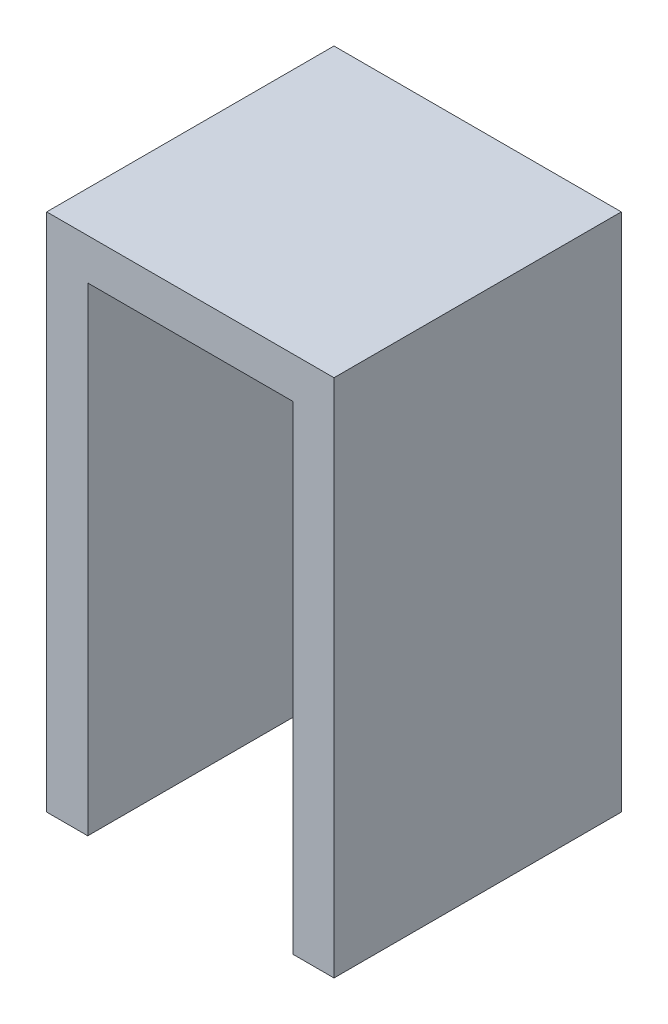
ISO-10303-21;
HEADER;
FILE_DESCRIPTION(('STEP AP214'),'2;1');
FILE_NAME('part.step','',(''),(''),'','','');
FILE_SCHEMA(('AUTOMOTIVE_DESIGN { 1 0 10303 214 1 1 1 1 }'));
ENDSEC;
DATA;
#1=APPLICATION_CONTEXT('core data for automotive mechanical design processes');
#2=APPLICATION_PROTOCOL_DEFINITION('international standard','automotive_design',2000,#1);
#3=PRODUCT_CONTEXT('',#1,'mechanical');
#4=PRODUCT('Part','Part','',(#3));
#5=PRODUCT_RELATED_PRODUCT_CATEGORY('part','',(#4));
#6=PRODUCT_DEFINITION_FORMATION('','',#4);
#7=PRODUCT_DEFINITION_CONTEXT('part definition',#1,'design');
#8=PRODUCT_DEFINITION('design','',#6,#7);
#9=PRODUCT_DEFINITION_SHAPE('','',#8);
#10=(LENGTH_UNIT() NAMED_UNIT(*) SI_UNIT(.MILLI.,.METRE.));
#11=(NAMED_UNIT(*) PLANE_ANGLE_UNIT() SI_UNIT($,.RADIAN.));
#12=(NAMED_UNIT(*) SI_UNIT($,.STERADIAN.) SOLID_ANGLE_UNIT());
#13=UNCERTAINTY_MEASURE_WITH_UNIT(LENGTH_MEASURE(1.E-05),#10,'distance_accuracy_value','');
#14=(GEOMETRIC_REPRESENTATION_CONTEXT(3) GLOBAL_UNCERTAINTY_ASSIGNED_CONTEXT((#13)) GLOBAL_UNIT_ASSIGNED_CONTEXT((#10,
#11,#12)) REPRESENTATION_CONTEXT('',''));
#15=CARTESIAN_POINT('',(0.,0.,0.));
#16=DIRECTION('',(0.,0.,1.));
#17=DIRECTION('',(1.,0.,0.));
#18=AXIS2_PLACEMENT_3D('',#15,#16,#17);
#19=CARTESIAN_POINT('',(0.,0.,18.));
#20=DIRECTION('',(0.,0.,1.));
#21=DIRECTION('',(1.,0.,0.));
#22=AXIS2_PLACEMENT_3D('',#19,#20,#21);
#23=PLANE('',#22);
#24=DIRECTION('',(1.,0.,0.));
#25=VECTOR('',#24,1.);
#26=CARTESIAN_POINT('',(-10.9980609307532,-26.6834319526627,18.));
#27=LINE('',#26,#25);
#28=CARTESIAN_POINT('',(-10.9980609307532,-26.6834319526627,18.));
#29=VERTEX_POINT('',#28);
#30=CARTESIAN_POINT('',(-7.99806093075323,-26.6834319526627,18.));
#31=VERTEX_POINT('',#30);
#32=EDGE_CURVE('E154',#29,#31,#27,.T.);
#33=ORIENTED_EDGE('',*,*,#32,.T.);
#34=DIRECTION('',(0.,-1.,0.));
#35=VECTOR('',#34,1.);
#36=CARTESIAN_POINT('',(-7.99806093075323,8.31656804733729,18.));
#37=LINE('',#36,#35);
#38=CARTESIAN_POINT('',(-7.99806093075323,8.31656804733729,18.));
#39=VERTEX_POINT('',#38);
#40=EDGE_CURVE('E204',#39,#31,#37,.T.);
#41=ORIENTED_EDGE('',*,*,#40,.F.);
#42=DIRECTION('',(-1.,0.,0.));
#43=VECTOR('',#42,1.);
#44=CARTESIAN_POINT('',(-7.99806093075323,8.31656804733729,18.));
#45=LINE('',#44,#43);
#46=CARTESIAN_POINT('',(7.00193906924676,8.31656804733729,18.));
#47=VERTEX_POINT('',#46);
#48=EDGE_CURVE('E211',#47,#39,#45,.T.);
#49=ORIENTED_EDGE('',*,*,#48,.F.);
#50=DIRECTION('',(0.,1.,0.));
#51=VECTOR('',#50,1.);
#52=CARTESIAN_POINT('',(7.00193906924676,8.31656804733729,18.));
#53=LINE('',#52,#51);
#54=CARTESIAN_POINT('',(7.00193906924677,-26.6834319526627,18.));
#55=VERTEX_POINT('',#54);
#56=EDGE_CURVE('E207',#55,#47,#53,.T.);
#57=ORIENTED_EDGE('',*,*,#56,.F.);
#58=CARTESIAN_POINT('',(10.0019390692468,-26.6834319526627,18.));
#59=VERTEX_POINT('',#58);
#60=EDGE_CURVE('E149',#55,#59,#27,.T.);
#61=ORIENTED_EDGE('',*,*,#60,.T.);
#62=DIRECTION('',(0.,1.,0.));
#63=VECTOR('',#62,1.);
#64=CARTESIAN_POINT('',(10.0019390692468,11.3165680473373,18.));
#65=LINE('',#64,#63);
#66=CARTESIAN_POINT('',(10.0019390692468,11.3165680473373,18.));
#67=VERTEX_POINT('',#66);
#68=EDGE_CURVE('E158',#59,#67,#65,.T.);
#69=ORIENTED_EDGE('',*,*,#68,.T.);
#70=DIRECTION('',(-1.,0.,0.));
#71=VECTOR('',#70,1.);
#72=CARTESIAN_POINT('',(-10.9980609307532,11.3165680473373,18.));
#73=LINE('',#72,#71);
#74=CARTESIAN_POINT('',(-10.9980609307532,11.3165680473373,18.));
#75=VERTEX_POINT('',#74);
#76=EDGE_CURVE('E63',#67,#75,#73,.T.);
#77=ORIENTED_EDGE('',*,*,#76,.T.);
#78=DIRECTION('',(0.,-1.,0.));
#79=VECTOR('',#78,1.);
#80=CARTESIAN_POINT('',(-10.9980609307532,11.3165680473373,18.));
#81=LINE('',#80,#79);
#82=EDGE_CURVE('E144',#75,#29,#81,.T.);
#83=ORIENTED_EDGE('',*,*,#82,.T.);
#84=EDGE_LOOP('',(#33,#41,#49,#57,#61,#69,#77,#83));
#85=FACE_BOUND('',#84,.T.);
#86=ADVANCED_FACE('F39',(#85),#23,.T.);
#87=CARTESIAN_POINT('',(-10.9980609307532,11.3165680473373,18.));
#88=DIRECTION('',(1.,0.,0.));
#89=DIRECTION('',(0.,1.,0.));
#90=AXIS2_PLACEMENT_3D('',#87,#88,#89);
#91=PLANE('',#90);
#92=DIRECTION('',(0.,0.,-1.));
#93=VECTOR('',#92,1.);
#94=CARTESIAN_POINT('',(-10.9980609307532,11.3165680473373,18.));
#95=LINE('',#94,#93);
#96=CARTESIAN_POINT('',(-10.9980609307532,11.3165680473373,-3.));
#97=VERTEX_POINT('',#96);
#98=EDGE_CURVE('E163',#75,#97,#95,.T.);
#99=ORIENTED_EDGE('',*,*,#98,.T.);
#100=DIRECTION('',(0.,1.,0.));
#101=VECTOR('',#100,1.);
#102=CARTESIAN_POINT('',(-10.9980609307532,11.3165680473373,-3.));
#103=LINE('',#102,#101);
#104=CARTESIAN_POINT('',(-10.9980609307532,-26.6834319526627,-3.));
#105=VERTEX_POINT('',#104);
#106=EDGE_CURVE('E188',#105,#97,#103,.T.);
#107=ORIENTED_EDGE('',*,*,#106,.F.);
#108=DIRECTION('',(0.,0.,-1.));
#109=VECTOR('',#108,1.);
#110=CARTESIAN_POINT('',(-10.9980609307532,-26.6834319526627,18.));
#111=LINE('',#110,#109);
#112=EDGE_CURVE('E11',#29,#105,#111,.T.);
#113=ORIENTED_EDGE('',*,*,#112,.F.);
#114=ORIENTED_EDGE('',*,*,#82,.F.);
#115=EDGE_LOOP('',(#99,#107,#113,#114));
#116=FACE_BOUND('',#115,.T.);
#117=ADVANCED_FACE('F41',(#116),#91,.F.);
#118=CARTESIAN_POINT('',(-10.9980609307532,-26.6834319526627,18.));
#119=DIRECTION('',(0.,1.,0.));
#120=DIRECTION('',(0.,0.,1.));
#121=AXIS2_PLACEMENT_3D('',#118,#119,#120);
#122=PLANE('',#121);
#123=DIRECTION('',(1.,0.,0.));
#124=VECTOR('',#123,1.);
#125=CARTESIAN_POINT('',(-7.99806093075323,-26.6834319526627,3.));
#126=LINE('',#125,#124);
#127=CARTESIAN_POINT('',(-7.99806093075323,-26.6834319526627,3.));
#128=VERTEX_POINT('',#127);
#129=CARTESIAN_POINT('',(7.00193906924677,-26.6834319526627,3.));
#130=VERTEX_POINT('',#129);
#131=EDGE_CURVE('E240',#128,#130,#126,.T.);
#132=ORIENTED_EDGE('',*,*,#131,.F.);
#133=DIRECTION('',(0.,0.,-1.));
#134=VECTOR('',#133,1.);
#135=CARTESIAN_POINT('',(-7.99806093075323,-26.6834319526627,18.));
#136=LINE('',#135,#134);
#137=EDGE_CURVE('E124',#31,#128,#136,.T.);
#138=ORIENTED_EDGE('',*,*,#137,.F.);
#139=ORIENTED_EDGE('',*,*,#32,.F.);
#140=ORIENTED_EDGE('',*,*,#112,.T.);
#141=DIRECTION('',(-1.,0.,0.));
#142=VECTOR('',#141,1.);
#143=CARTESIAN_POINT('',(10.0019390692468,-26.6834319526627,-3.));
#144=LINE('',#143,#142);
#145=CARTESIAN_POINT('',(10.0019390692468,-26.6834319526627,-3.));
#146=VERTEX_POINT('',#145);
#147=EDGE_CURVE('E181',#146,#105,#144,.T.);
#148=ORIENTED_EDGE('',*,*,#147,.F.);
#149=DIRECTION('',(0.,0.,-1.));
#150=VECTOR('',#149,1.);
#151=CARTESIAN_POINT('',(10.0019390692468,-26.6834319526627,18.));
#152=LINE('',#151,#150);
#153=EDGE_CURVE('E48',#59,#146,#152,.T.);
#154=ORIENTED_EDGE('',*,*,#153,.F.);
#155=ORIENTED_EDGE('',*,*,#60,.F.);
#156=DIRECTION('',(0.,0.,1.));
#157=VECTOR('',#156,1.);
#158=CARTESIAN_POINT('',(7.00193906924677,-26.6834319526627,18.));
#159=LINE('',#158,#157);
#160=EDGE_CURVE('E137',#130,#55,#159,.T.);
#161=ORIENTED_EDGE('',*,*,#160,.F.);
#162=EDGE_LOOP('',(#132,#138,#139,#140,#148,#154,#155,#161));
#163=FACE_BOUND('',#162,.T.);
#164=ADVANCED_FACE('F182',(#163),#122,.F.);
#165=CARTESIAN_POINT('',(10.0019390692468,11.3165680473373,18.));
#166=DIRECTION('',(-1.,0.,0.));
#167=DIRECTION('',(0.,-1.,0.));
#168=AXIS2_PLACEMENT_3D('',#165,#166,#167);
#169=PLANE('',#168);
#170=ORIENTED_EDGE('',*,*,#153,.T.);
#171=DIRECTION('',(0.,-1.,0.));
#172=VECTOR('',#171,1.);
#173=CARTESIAN_POINT('',(10.0019390692468,11.3165680473373,-3.));
#174=LINE('',#173,#172);
#175=CARTESIAN_POINT('',(10.0019390692468,11.3165680473373,-3.));
#176=VERTEX_POINT('',#175);
#177=EDGE_CURVE('E177',#176,#146,#174,.T.);
#178=ORIENTED_EDGE('',*,*,#177,.F.);
#179=DIRECTION('',(0.,0.,-1.));
#180=VECTOR('',#179,1.);
#181=CARTESIAN_POINT('',(10.0019390692468,11.3165680473373,18.));
#182=LINE('',#181,#180);
#183=EDGE_CURVE('E166',#67,#176,#182,.T.);
#184=ORIENTED_EDGE('',*,*,#183,.F.);
#185=ORIENTED_EDGE('',*,*,#68,.F.);
#186=EDGE_LOOP('',(#170,#178,#184,#185));
#187=FACE_BOUND('',#186,.T.);
#188=ADVANCED_FACE('F174',(#187),#169,.F.);
#189=CARTESIAN_POINT('',(-10.9980609307532,11.3165680473373,18.));
#190=DIRECTION('',(0.,-1.,0.));
#191=DIRECTION('',(0.,0.,-1.));
#192=AXIS2_PLACEMENT_3D('',#189,#190,#191);
#193=PLANE('',#192);
#194=ORIENTED_EDGE('',*,*,#183,.T.);
#195=DIRECTION('',(1.,0.,0.));
#196=VECTOR('',#195,1.);
#197=CARTESIAN_POINT('',(10.0019390692468,11.3165680473373,-3.));
#198=LINE('',#197,#196);
#199=EDGE_CURVE('E193',#97,#176,#198,.T.);
#200=ORIENTED_EDGE('',*,*,#199,.F.);
#201=ORIENTED_EDGE('',*,*,#98,.F.);
#202=ORIENTED_EDGE('',*,*,#76,.F.);
#203=EDGE_LOOP('',(#194,#200,#201,#202));
#204=FACE_BOUND('',#203,.T.);
#205=ADVANCED_FACE('F249',(#204),#193,.F.);
#206=CARTESIAN_POINT('',(-7.99806093075323,8.31656804733729,18.));
#207=DIRECTION('',(1.,0.,0.));
#208=DIRECTION('',(0.,1.,0.));
#209=AXIS2_PLACEMENT_3D('',#206,#207,#208);
#210=PLANE('',#209);
#211=DIRECTION('',(0.,-1.,0.));
#212=VECTOR('',#211,1.);
#213=CARTESIAN_POINT('',(-7.99806093075323,8.31656804733729,0.));
#214=LINE('',#213,#212);
#215=CARTESIAN_POINT('',(-7.99806093075323,8.31656804733729,0.));
#216=VERTEX_POINT('',#215);
#217=CARTESIAN_POINT('',(-7.99806093075323,-23.6834319526627,0.));
#218=VERTEX_POINT('',#217);
#219=EDGE_CURVE('E203',#216,#218,#214,.T.);
#220=ORIENTED_EDGE('',*,*,#219,.F.);
#221=DIRECTION('',(0.,0.,-1.));
#222=VECTOR('',#221,1.);
#223=CARTESIAN_POINT('',(-7.99806093075323,8.31656804733729,18.));
#224=LINE('',#223,#222);
#225=EDGE_CURVE('E214',#39,#216,#224,.T.);
#226=ORIENTED_EDGE('',*,*,#225,.F.);
#227=ORIENTED_EDGE('',*,*,#40,.T.);
#228=ORIENTED_EDGE('',*,*,#137,.T.);
#229=DIRECTION('',(0.,-1.,0.));
#230=VECTOR('',#229,1.);
#231=CARTESIAN_POINT('',(-7.99806093075323,-23.6834319526627,3.));
#232=LINE('',#231,#230);
#233=CARTESIAN_POINT('',(-7.99806093075323,-23.6834319526627,3.));
#234=VERTEX_POINT('',#233);
#235=EDGE_CURVE('E116',#234,#128,#232,.T.);
#236=ORIENTED_EDGE('',*,*,#235,.F.);
#237=DIRECTION('',(0.,0.,-1.));
#238=VECTOR('',#237,1.);
#239=CARTESIAN_POINT('',(-7.99806093075323,-23.6834319526627,18.));
#240=LINE('',#239,#238);
#241=EDGE_CURVE('E121',#234,#218,#240,.T.);
#242=ORIENTED_EDGE('',*,*,#241,.T.);
#243=EDGE_LOOP('',(#220,#226,#227,#228,#236,#242));
#244=FACE_BOUND('',#243,.T.);
#245=ADVANCED_FACE('F119',(#244),#210,.T.);
#246=CARTESIAN_POINT('',(-7.99806093075323,-23.6834319526627,18.));
#247=DIRECTION('',(0.,1.,0.));
#248=DIRECTION('',(-1.,0.,0.));
#249=AXIS2_PLACEMENT_3D('',#246,#247,#248);
#250=PLANE('',#249);
#251=DIRECTION('',(1.,0.,0.));
#252=VECTOR('',#251,1.);
#253=CARTESIAN_POINT('',(-7.99806093075323,-23.6834319526627,3.));
#254=LINE('',#253,#252);
#255=CARTESIAN_POINT('',(7.00193906924677,-23.6834319526627,3.));
#256=VERTEX_POINT('',#255);
#257=EDGE_CURVE('E130',#234,#256,#254,.T.);
#258=ORIENTED_EDGE('',*,*,#257,.T.);
#259=DIRECTION('',(0.,0.,-1.));
#260=VECTOR('',#259,1.);
#261=CARTESIAN_POINT('',(7.00193906924677,-23.6834319526627,18.));
#262=LINE('',#261,#260);
#263=CARTESIAN_POINT('',(7.00193906924677,-23.6834319526627,0.));
#264=VERTEX_POINT('',#263);
#265=EDGE_CURVE('E145',#256,#264,#262,.T.);
#266=ORIENTED_EDGE('',*,*,#265,.T.);
#267=DIRECTION('',(1.,0.,0.));
#268=VECTOR('',#267,1.);
#269=CARTESIAN_POINT('',(-7.99806093075323,-23.6834319526627,0.));
#270=LINE('',#269,#268);
#271=EDGE_CURVE('E141',#218,#264,#270,.T.);
#272=ORIENTED_EDGE('',*,*,#271,.F.);
#273=ORIENTED_EDGE('',*,*,#241,.F.);
#274=EDGE_LOOP('',(#258,#266,#272,#273));
#275=FACE_BOUND('',#274,.T.);
#276=ADVANCED_FACE('F139',(#275),#250,.T.);
#277=CARTESIAN_POINT('',(7.00193906924676,8.31656804733729,18.));
#278=DIRECTION('',(-1.,0.,0.));
#279=DIRECTION('',(0.,-1.,0.));
#280=AXIS2_PLACEMENT_3D('',#277,#278,#279);
#281=PLANE('',#280);
#282=DIRECTION('',(0.,1.,0.));
#283=VECTOR('',#282,1.);
#284=CARTESIAN_POINT('',(7.00193906924676,8.31656804733729,0.));
#285=LINE('',#284,#283);
#286=CARTESIAN_POINT('',(7.00193906924676,8.31656804733729,0.));
#287=VERTEX_POINT('',#286);
#288=EDGE_CURVE('E219',#264,#287,#285,.T.);
#289=ORIENTED_EDGE('',*,*,#288,.F.);
#290=ORIENTED_EDGE('',*,*,#265,.F.);
#291=DIRECTION('',(0.,-1.,0.));
#292=VECTOR('',#291,1.);
#293=CARTESIAN_POINT('',(7.00193906924677,-23.6834319526627,3.));
#294=LINE('',#293,#292);
#295=EDGE_CURVE('E129',#256,#130,#294,.T.);
#296=ORIENTED_EDGE('',*,*,#295,.T.);
#297=ORIENTED_EDGE('',*,*,#160,.T.);
#298=ORIENTED_EDGE('',*,*,#56,.T.);
#299=DIRECTION('',(0.,0.,-1.));
#300=VECTOR('',#299,1.);
#301=CARTESIAN_POINT('',(7.00193906924676,8.31656804733729,18.));
#302=LINE('',#301,#300);
#303=EDGE_CURVE('E55',#47,#287,#302,.T.);
#304=ORIENTED_EDGE('',*,*,#303,.T.);
#305=EDGE_LOOP('',(#289,#290,#296,#297,#298,#304));
#306=FACE_BOUND('',#305,.T.);
#307=ADVANCED_FACE('F230',(#306),#281,.T.);
#308=CARTESIAN_POINT('',(-7.99806093075323,8.31656804733729,18.));
#309=DIRECTION('',(0.,-1.,0.));
#310=DIRECTION('',(0.,0.,-1.));
#311=AXIS2_PLACEMENT_3D('',#308,#309,#310);
#312=PLANE('',#311);
#313=DIRECTION('',(-1.,0.,0.));
#314=VECTOR('',#313,1.);
#315=CARTESIAN_POINT('',(-7.99806093075323,8.31656804733729,0.));
#316=LINE('',#315,#314);
#317=EDGE_CURVE('E208',#287,#216,#316,.T.);
#318=ORIENTED_EDGE('',*,*,#317,.F.);
#319=ORIENTED_EDGE('',*,*,#303,.F.);
#320=ORIENTED_EDGE('',*,*,#48,.T.);
#321=ORIENTED_EDGE('',*,*,#225,.T.);
#322=EDGE_LOOP('',(#318,#319,#320,#321));
#323=FACE_BOUND('',#322,.T.);
#324=ADVANCED_FACE('F233',(#323),#312,.T.);
#325=CARTESIAN_POINT('',(0.,0.,0.));
#326=DIRECTION('',(0.,0.,-1.));
#327=DIRECTION('',(-1.,0.,0.));
#328=AXIS2_PLACEMENT_3D('',#325,#326,#327);
#329=PLANE('',#328);
#330=ORIENTED_EDGE('',*,*,#317,.T.);
#331=ORIENTED_EDGE('',*,*,#219,.T.);
#332=ORIENTED_EDGE('',*,*,#271,.T.);
#333=ORIENTED_EDGE('',*,*,#288,.T.);
#334=EDGE_LOOP('',(#330,#331,#332,#333));
#335=FACE_BOUND('',#334,.T.);
#336=ADVANCED_FACE('F236',(#335),#329,.F.);
#337=CARTESIAN_POINT('',(0.,0.,-3.));
#338=DIRECTION('',(0.,0.,-1.));
#339=DIRECTION('',(-1.,0.,0.));
#340=AXIS2_PLACEMENT_3D('',#337,#338,#339);
#341=PLANE('',#340);
#342=ORIENTED_EDGE('',*,*,#177,.T.);
#343=ORIENTED_EDGE('',*,*,#147,.T.);
#344=ORIENTED_EDGE('',*,*,#106,.T.);
#345=ORIENTED_EDGE('',*,*,#199,.T.);
#346=EDGE_LOOP('',(#342,#343,#344,#345));
#347=FACE_BOUND('',#346,.T.);
#348=ADVANCED_FACE('F191',(#347),#341,.T.);
#349=CARTESIAN_POINT('',(-7.99806093075323,-23.6834319526627,3.));
#350=DIRECTION('',(0.,0.,-1.));
#351=DIRECTION('',(-1.,0.,0.));
#352=AXIS2_PLACEMENT_3D('',#349,#350,#351);
#353=PLANE('',#352);
#354=ORIENTED_EDGE('',*,*,#131,.T.);
#355=ORIENTED_EDGE('',*,*,#295,.F.);
#356=ORIENTED_EDGE('',*,*,#257,.F.);
#357=ORIENTED_EDGE('',*,*,#235,.T.);
#358=EDGE_LOOP('',(#354,#355,#356,#357));
#359=FACE_BOUND('',#358,.T.);
#360=ADVANCED_FACE('F133',(#359),#353,.F.);
#361=CLOSED_SHELL('',(#86,#117,#164,#188,#205,#245,#276,#307,#324,#336,#348,#360));
#362=MANIFOLD_SOLID_BREP('B2',#361);
#363=ADVANCED_BREP_SHAPE_REPRESENTATION('',(#18,#362),#14);
#364=SHAPE_DEFINITION_REPRESENTATION(#9,#363);
ENDSEC;
END-ISO-10303-21;
